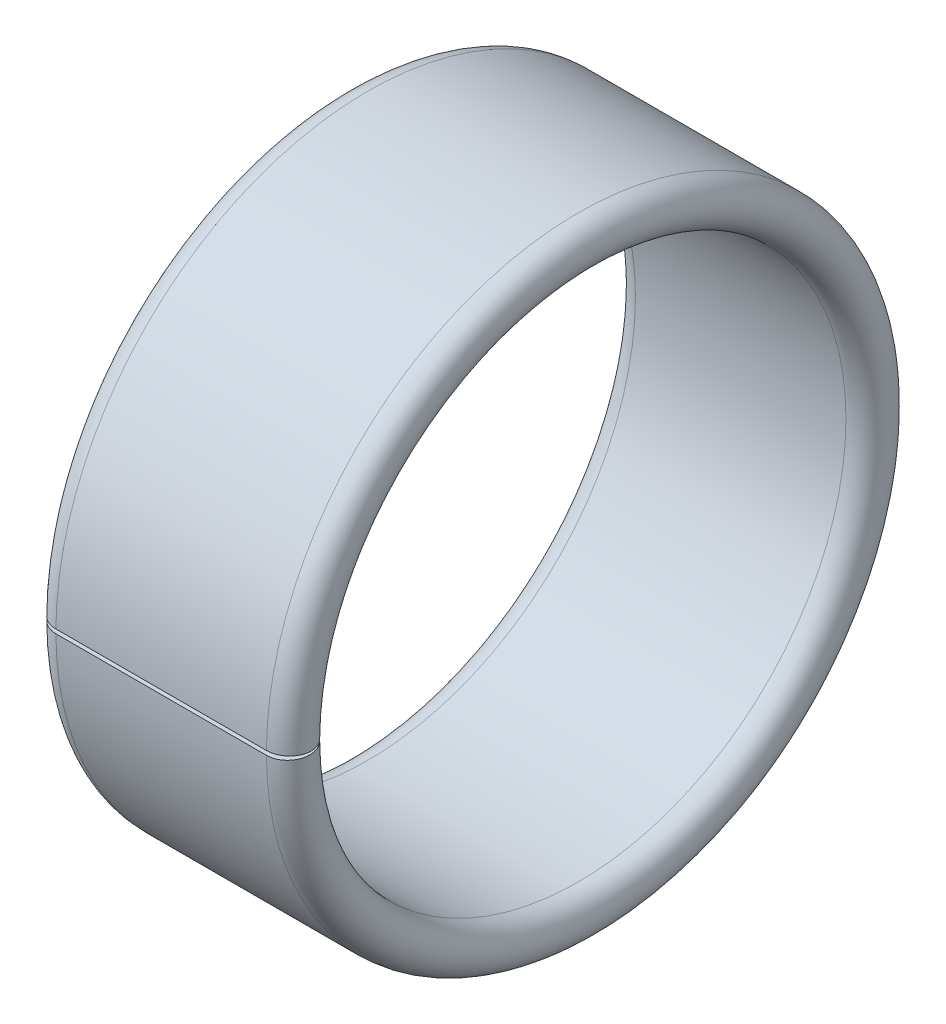
ISO-10303-21;
HEADER;
FILE_DESCRIPTION(('STEP AP214'),'2;1');
FILE_NAME('part.step','',(''),(''),'','','');
FILE_SCHEMA(('AUTOMOTIVE_DESIGN { 1 0 10303 214 1 1 1 1 }'));
ENDSEC;
DATA;
#1=APPLICATION_CONTEXT('core data for automotive mechanical design processes');
#2=APPLICATION_PROTOCOL_DEFINITION('international standard','automotive_design',2000,#1);
#3=PRODUCT_CONTEXT('',#1,'mechanical');
#4=PRODUCT('Part','Part','',(#3));
#5=PRODUCT_RELATED_PRODUCT_CATEGORY('part','',(#4));
#6=PRODUCT_DEFINITION_FORMATION('','',#4);
#7=PRODUCT_DEFINITION_CONTEXT('part definition',#1,'design');
#8=PRODUCT_DEFINITION('design','',#6,#7);
#9=PRODUCT_DEFINITION_SHAPE('','',#8);
#10=(LENGTH_UNIT() NAMED_UNIT(*) SI_UNIT(.MILLI.,.METRE.));
#11=(NAMED_UNIT(*) PLANE_ANGLE_UNIT() SI_UNIT($,.RADIAN.));
#12=(NAMED_UNIT(*) SI_UNIT($,.STERADIAN.) SOLID_ANGLE_UNIT());
#13=UNCERTAINTY_MEASURE_WITH_UNIT(LENGTH_MEASURE(1.E-05),#10,'distance_accuracy_value','');
#14=(GEOMETRIC_REPRESENTATION_CONTEXT(3) GLOBAL_UNCERTAINTY_ASSIGNED_CONTEXT((#13)) GLOBAL_UNIT_ASSIGNED_CONTEXT((#10,
#11,#12)) REPRESENTATION_CONTEXT('',''));
#15=CARTESIAN_POINT('',(0.,0.,0.));
#16=DIRECTION('',(0.,0.,1.));
#17=DIRECTION('',(1.,0.,0.));
#18=AXIS2_PLACEMENT_3D('',#15,#16,#17);
#19=CARTESIAN_POINT('',(0.425,0.,0.));
#20=DIRECTION('',(1.,0.,0.));
#21=DIRECTION('',(0.,0.,-1.));
#22=AXIS2_PLACEMENT_3D('',#19,#20,#21);
#23=TOROIDAL_SURFACE('',#22,5.575,0.425);
#24=CARTESIAN_POINT('',(0.425,0.,0.));
#25=DIRECTION('',(1.,0.,0.));
#26=DIRECTION('',(0.,0.,-1.));
#27=AXIS2_PLACEMENT_3D('',#24,#25,#26);
#28=CIRCLE('',#27,6.);
#29=CARTESIAN_POINT('',(0.425,-0.0396784115187026,5.99986880053717));
#30=VERTEX_POINT('',#29);
#31=CARTESIAN_POINT('',(0.425,0.0396784115187032,5.99986880053717));
#32=VERTEX_POINT('',#31);
#33=EDGE_CURVE('E82',#30,#32,#28,.T.);
#34=ORIENTED_EDGE('',*,*,#33,.F.);
#35=CARTESIAN_POINT('',(0.425199999999997,-0.0396784098757157,5.99986875348818));
#36=CARTESIAN_POINT('',(0.401297961018159,-0.0396795124633686,5.99990032746748));
#37=CARTESIAN_POINT('',(0.37740107020298,-0.0396088388147302,5.99787649896464));
#38=CARTESIAN_POINT('',(0.33029874051948,-0.0393291612201546,5.98986758052882));
#39=CARTESIAN_POINT('',(0.307092801505564,-0.0391202600059158,5.98388543244677));
#40=CARTESIAN_POINT('',(0.262005692115016,-0.0385692089481122,5.96810539478368));
#41=CARTESIAN_POINT('',(0.240125136849378,-0.0382269977746104,5.95830574894304));
#42=CARTESIAN_POINT('',(0.198324334070969,-0.03741936618874,5.93517820629077));
#43=CARTESIAN_POINT('',(0.178403708037,-0.0369539696314934,5.92185099260046));
#44=CARTESIAN_POINT('',(0.14107929282965,-0.0359130004402113,5.89204153517919));
#45=CARTESIAN_POINT('',(0.123675985506353,-0.0353374067617664,5.8755586888152));
#46=CARTESIAN_POINT('',(0.0918813210510851,-0.0340923703244203,5.8399055100489));
#47=CARTESIAN_POINT('',(0.0774904273012889,-0.0334229131534484,5.82073476493888));
#48=CARTESIAN_POINT('',(0.0521271438008031,-0.0320089771363153,5.78024493502642));
#49=CARTESIAN_POINT('',(0.0411559145084189,-0.0312644729362279,5.75892512418252));
#50=CARTESIAN_POINT('',(0.0229497118107499,-0.0297218165812698,5.71474922607344));
#51=CARTESIAN_POINT('',(0.0157145080871575,-0.0289236677369103,5.69189323360889));
#52=CARTESIAN_POINT('',(0.00518167017992458,-0.0272959754061034,5.64528222375724));
#53=CARTESIAN_POINT('',(0.00188569418208471,-0.0264664188503125,5.62152683211311));
#54=CARTESIAN_POINT('',(-0.000670035927541663,-0.0247997476343115,5.57379961303236));
#55=CARTESIAN_POINT('',(7.03102109674031E-05,-0.0239626327868913,5.54982778023475));
#56=CARTESIAN_POINT('',(0.00556703019496042,-0.0223044131675807,5.50234258321747));
#57=CARTESIAN_POINT('',(0.0103243748448127,-0.0214833123149389,5.4788293312304));
#58=CARTESIAN_POINT('',(0.0237215548211492,-0.0198806417794876,5.43293485184814));
#59=CARTESIAN_POINT('',(0.0323613786467166,-0.0190990719795843,5.41055362109983));
#60=CARTESIAN_POINT('',(0.0532787180155254,-0.0175976584487659,5.36755876294892));
#61=CARTESIAN_POINT('',(0.065556228572111,-0.0168778146332367,5.34694513312328));
#62=CARTESIAN_POINT('',(0.0934003339614719,-0.0155203459203222,5.30807231523663));
#63=CARTESIAN_POINT('',(0.108966764356867,-0.0148827169149774,5.28981300953904));
#64=CARTESIAN_POINT('',(0.142939524663492,-0.0137080446713584,5.25617479764636));
#65=CARTESIAN_POINT('',(0.161344540086454,-0.0131709551289628,5.24079456547471));
#66=CARTESIAN_POINT('',(0.200484474351785,-0.0122121384750847,5.21333764892238));
#67=CARTESIAN_POINT('',(0.221220119988428,-0.0117904474916054,5.20126199911234));
#68=CARTESIAN_POINT('',(0.264427480123911,-0.0110745975918477,5.18076274007033));
#69=CARTESIAN_POINT('',(0.286899374758853,-0.0107804519294058,5.17233951037857));
#70=CARTESIAN_POINT('',(0.332911748592944,-0.0103286338091498,5.15940113224911));
#71=CARTESIAN_POINT('',(0.356450543801536,-0.0101707536588862,5.15488003627782));
#72=CARTESIAN_POINT('',(0.395142694798071,-0.0100272666463959,5.15077110584534));
#73=CARTESIAN_POINT('',(0.410175457686809,-0.0099995278933128,5.1499767718863));
#74=CARTESIAN_POINT('',(0.4252,-0.0100000016432227,5.14999033830871));
#75=B_SPLINE_CURVE_WITH_KNOTS('',3,(#35,#36,#37,#38,#39,#40,#41,#42,#43,#44,#45,#46,#47,#48,#49,
#50,#51,#52,#53,#54,#55,#56,#57,#58,#59,#60,#61,#62,#63,#64,#65,#66,#67,#68,#69,#70,#71,#72,#73,
#74),.UNSPECIFIED.,.F.,.F.,(4,2,2,2,2,2,2,2,2,2,2,2,2,2,2,2,2,2,2,4),(0.,0.0716107973596128,
0.143168432759965,0.214759027573409,0.286335768839988,0.357926192818741,0.429527621059498,
0.501153320756555,0.572774604348921,0.644426025730323,0.716079226729074,0.787749749406292,
0.859420059778109,0.931090271902455,1.00275690155145,1.07439044300845,1.14604638529786,
1.21770977191114,1.28926373713111,1.33433683980956),.UNSPECIFIED.);
#76=CARTESIAN_POINT('',(0.425,-0.0100000000000006,5.14999029125298));
#77=VERTEX_POINT('',#76);
#78=EDGE_CURVE('E61',#30,#77,#75,.T.);
#79=ORIENTED_EDGE('',*,*,#78,.T.);
#80=CARTESIAN_POINT('',(0.425,0.,0.));
#81=DIRECTION('',(1.,0.,0.));
#82=DIRECTION('',(0.,0.,-1.));
#83=AXIS2_PLACEMENT_3D('',#80,#81,#82);
#84=CIRCLE('',#83,5.15);
#85=CARTESIAN_POINT('',(0.425,0.0100000000000007,5.14999029125298));
#86=VERTEX_POINT('',#85);
#87=EDGE_CURVE('E84',#77,#86,#84,.T.);
#88=ORIENTED_EDGE('',*,*,#87,.T.);
#89=CARTESIAN_POINT('',(0.4252,0.0100000016432228,5.14999033830871));
#90=CARTESIAN_POINT('',(0.401300061510052,0.00999889829661909,5.14995874259591));
#91=CARTESIAN_POINT('',(0.377405301024684,0.0100695703046586,5.15198252411814));
#92=CARTESIAN_POINT('',(0.330307348995726,0.01034923608597,5.15999110426633));
#93=CARTESIAN_POINT('',(0.30710365368102,0.0105581263873647,5.16597293984542));
#94=CARTESIAN_POINT('',(0.262020984166488,0.0111091398654659,5.18175190136663));
#95=CARTESIAN_POINT('',(0.24014262231371,0.0114513240938828,5.19155077560099));
#96=CARTESIAN_POINT('',(0.198345822686927,0.0122588791649534,5.21467612715607));
#97=CARTESIAN_POINT('',(0.178427009856835,0.0127242263711442,5.22800192761705));
#98=CARTESIAN_POINT('',(0.141103984405552,0.0137651134606776,5.25780903395185));
#99=CARTESIAN_POINT('',(0.123700461264472,0.0143406834576597,5.27429120216747));
#100=CARTESIAN_POINT('',(0.091904829281524,0.0155856628730052,5.30994274803732));
#101=CARTESIAN_POINT('',(0.077513185233488,0.0162550867483405,5.32911253968506));
#102=CARTESIAN_POINT('',(0.0521461380057571,0.0176690375651257,5.3696027934041));
#103=CARTESIAN_POINT('',(0.0411723128683477,0.0184135989889231,5.39092424292065));
#104=CARTESIAN_POINT('',(0.0229611391467007,0.0199563835120357,5.43510381128547));
#105=CARTESIAN_POINT('',(0.0157235612215139,0.0207546033142546,5.45796183571725));
#106=CARTESIAN_POINT('',(0.0051863357599662,0.0223824662686903,5.50457773159035));
#107=CARTESIAN_POINT('',(0.00188841852102415,0.0232121230631014,5.528335993693));
#108=CARTESIAN_POINT('',(-0.000670252535627302,0.0248790044326834,5.57606923078492));
#109=CARTESIAN_POINT('',(6.90917045371695E-05,0.0257162291911736,5.60004421102378));
#110=CARTESIAN_POINT('',(0.00556477624607619,0.0273745840035008,5.64753327946252));
#111=CARTESIAN_POINT('',(0.0103216797886868,0.0281957117841072,5.67104730256561));
#112=CARTESIAN_POINT('',(0.0237186286467228,0.029798431336211,5.71694318560113));
#113=CARTESIAN_POINT('',(0.0323586592759047,0.0305800232572231,5.73932504981511));
#114=CARTESIAN_POINT('',(0.0532757734050016,0.0320813721810442,5.78231805786369));
#115=CARTESIAN_POINT('',(0.0655523920533815,0.032801137071813,5.8029294275799));
#116=CARTESIAN_POINT('',(0.093394461879696,0.0341584504951348,5.84179779855444));
#117=CARTESIAN_POINT('',(0.108959747643668,0.0347960031602167,5.86005491815293));
#118=CARTESIAN_POINT('',(0.142929295267512,0.0359705105119655,5.89368840816025));
#119=CARTESIAN_POINT('',(0.161332148161209,0.0365075148334816,5.90906619992521));
#120=CARTESIAN_POINT('',(0.200467172331264,0.0374661864315201,5.93651896262178));
#121=CARTESIAN_POINT('',(0.221200070945568,0.0378878175517337,5.94859289817217));
#122=CARTESIAN_POINT('',(0.264403420111526,0.0386036195184057,5.9690907845902));
#123=CARTESIAN_POINT('',(0.286874209272734,0.0388977654516245,5.97751402203599));
#124=CARTESIAN_POINT('',(0.332884295408352,0.0393496106584256,5.99045317582262));
#125=CARTESIAN_POINT('',(0.356421910498427,0.0395075173471265,5.99497503175533));
#126=CARTESIAN_POINT('',(0.39512278058569,0.0396511121676225,5.99908704940517));
#127=CARTESIAN_POINT('',(0.410165501873883,0.0396788837872204,5.99988232453805));
#128=CARTESIAN_POINT('',(0.425199999999997,0.0396784098757162,5.99986875348818));
#129=B_SPLINE_CURVE_WITH_KNOTS('',3,(#89,#90,#91,#92,#93,#94,#95,#96,#97,#98,#99,#100,#101,#102,
#103,#104,#105,#106,#107,#108,#109,#110,#111,#112,#113,#114,#115,#116,#117,#118,#119,#120,#121,
#122,#123,#124,#125,#126,#127,#128),.UNSPECIFIED.,.F.,.F.,(4,2,2,2,2,2,2,2,2,2,2,2,2,2,2,2,2,2,
2,4),(0.,0.0716044437633951,0.143155344133726,0.214739055082886,0.286309038202233,
0.357898602711167,0.42949920680395,0.50113282079449,0.572762037197255,0.644422701570849,
0.716085106461791,0.787757559722859,0.859429741916249,0.931092766471421,1.0027521873648,
1.07437614038153,1.14602251367947,1.2176828818529,1.28923395843,1.33433689475925),.UNSPECIFIED.);
#130=EDGE_CURVE('E80',#86,#32,#129,.T.);
#131=ORIENTED_EDGE('',*,*,#130,.T.);
#132=EDGE_LOOP('',(#34,#79,#88,#131));
#133=FACE_BOUND('',#132,.T.);
#134=ADVANCED_FACE('F38',(#133),#23,.T.);
#135=CARTESIAN_POINT('',(4.9,0.,0.));
#136=DIRECTION('',(1.,0.,0.));
#137=DIRECTION('',(0.,0.,-1.));
#138=AXIS2_PLACEMENT_3D('',#135,#136,#137);
#139=CYLINDRICAL_SURFACE('',#138,5.15);
#140=ORIENTED_EDGE('',*,*,#87,.F.);
#141=DIRECTION('',(1.,0.,0.));
#142=VECTOR('',#141,1.);
#143=CARTESIAN_POINT('',(4.9,-0.0100000000000006,5.14999029125298));
#144=LINE('',#143,#142);
#145=CARTESIAN_POINT('',(4.475,-0.0100000000000006,5.14999029125298));
#146=VERTEX_POINT('',#145);
#147=EDGE_CURVE('E96',#77,#146,#144,.T.);
#148=ORIENTED_EDGE('',*,*,#147,.T.);
#149=CARTESIAN_POINT('',(4.475,0.,0.));
#150=DIRECTION('',(1.,0.,0.));
#151=DIRECTION('',(0.,0.,-1.));
#152=AXIS2_PLACEMENT_3D('',#149,#150,#151);
#153=CIRCLE('',#152,5.15);
#154=CARTESIAN_POINT('',(4.475,0.0100000000000007,5.14999029125299));
#155=VERTEX_POINT('',#154);
#156=EDGE_CURVE('E94',#146,#155,#153,.T.);
#157=ORIENTED_EDGE('',*,*,#156,.T.);
#158=DIRECTION('',(1.,0.,0.));
#159=VECTOR('',#158,1.);
#160=CARTESIAN_POINT('',(4.9,0.0100000000000007,5.14999029125298));
#161=LINE('',#160,#159);
#162=EDGE_CURVE('E111',#155,#86,#161,.F.);
#163=ORIENTED_EDGE('',*,*,#162,.T.);
#164=EDGE_LOOP('',(#140,#148,#157,#163));
#165=FACE_BOUND('',#164,.T.);
#166=ADVANCED_FACE('F110',(#165),#139,.F.);
#167=CARTESIAN_POINT('',(4.9,0.,0.));
#168=DIRECTION('',(1.,0.,0.));
#169=DIRECTION('',(0.,0.,-1.));
#170=AXIS2_PLACEMENT_3D('',#167,#168,#169);
#171=CYLINDRICAL_SURFACE('',#170,6.);
#172=CARTESIAN_POINT('',(4.475,0.,0.));
#173=DIRECTION('',(1.,0.,0.));
#174=DIRECTION('',(0.,0.,-1.));
#175=AXIS2_PLACEMENT_3D('',#172,#173,#174);
#176=CIRCLE('',#175,6.);
#177=CARTESIAN_POINT('',(4.475,-0.0396784115187026,5.99986880053717));
#178=VERTEX_POINT('',#177);
#179=CARTESIAN_POINT('',(4.475,0.0396784115187032,5.99986880053717));
#180=VERTEX_POINT('',#179);
#181=EDGE_CURVE('E92',#178,#180,#176,.T.);
#182=ORIENTED_EDGE('',*,*,#181,.F.);
#183=DIRECTION('',(1.,0.,0.));
#184=VECTOR('',#183,1.);
#185=CARTESIAN_POINT('',(4.9,-0.0396784115187026,5.99986880053717));
#186=LINE('',#185,#184);
#187=EDGE_CURVE('E11',#178,#30,#186,.F.);
#188=ORIENTED_EDGE('',*,*,#187,.T.);
#189=ORIENTED_EDGE('',*,*,#33,.T.);
#190=DIRECTION('',(1.,0.,0.));
#191=VECTOR('',#190,1.);
#192=CARTESIAN_POINT('',(4.9,0.0396784115187032,5.99986880053717));
#193=LINE('',#192,#191);
#194=EDGE_CURVE('E46',#32,#180,#193,.T.);
#195=ORIENTED_EDGE('',*,*,#194,.T.);
#196=EDGE_LOOP('',(#182,#188,#189,#195));
#197=FACE_BOUND('',#196,.T.);
#198=ADVANCED_FACE('F91',(#197),#171,.T.);
#199=CARTESIAN_POINT('',(4.475,0.,0.));
#200=DIRECTION('',(1.,0.,0.));
#201=DIRECTION('',(0.,0.,-1.));
#202=AXIS2_PLACEMENT_3D('',#199,#200,#201);
#203=TOROIDAL_SURFACE('',#202,5.575,0.425);
#204=ORIENTED_EDGE('',*,*,#156,.F.);
#205=CARTESIAN_POINT('',(4.4748,-0.0100000016432227,5.14999033830871));
#206=CARTESIAN_POINT('',(4.49869993848995,-0.00999889829661895,5.14995874259591));
#207=CARTESIAN_POINT('',(4.52259469897532,-0.0100695703046584,5.15198252411814));
#208=CARTESIAN_POINT('',(4.56969265100427,-0.0103492360859698,5.15999110426633));
#209=CARTESIAN_POINT('',(4.59289634631898,-0.0105581263873646,5.16597293984542));
#210=CARTESIAN_POINT('',(4.63797901583351,-0.0111091398654657,5.18175190136662));
#211=CARTESIAN_POINT('',(4.65985737768629,-0.0114513240938826,5.19155077560099));
#212=CARTESIAN_POINT('',(4.70165417731307,-0.0122588791649532,5.21467612715607));
#213=CARTESIAN_POINT('',(4.72157299014316,-0.0127242263711441,5.22800192761705));
#214=CARTESIAN_POINT('',(4.75889601559445,-0.0137651134606774,5.25780903395184));
#215=CARTESIAN_POINT('',(4.77629953873553,-0.0143406834576594,5.27429120216747));
#216=CARTESIAN_POINT('',(4.80809517071848,-0.0155856628730049,5.30994274803732));
#217=CARTESIAN_POINT('',(4.82248681476651,-0.0162550867483402,5.32911253968506));
#218=CARTESIAN_POINT('',(4.84785386199424,-0.0176690375651254,5.3696027934041));
#219=CARTESIAN_POINT('',(4.85882768713165,-0.0184135989889228,5.39092424292065));
#220=CARTESIAN_POINT('',(4.8770388608533,-0.0199563835120354,5.43510381128547));
#221=CARTESIAN_POINT('',(4.88427643877849,-0.0207546033142542,5.45796183571725));
#222=CARTESIAN_POINT('',(4.89481366424003,-0.0223824662686899,5.50457773159035));
#223=CARTESIAN_POINT('',(4.89811158147898,-0.023212123063101,5.52833599369299));
#224=CARTESIAN_POINT('',(4.90067025253563,-0.024879004432683,5.57606923078492));
#225=CARTESIAN_POINT('',(4.89993090829546,-0.0257162291911732,5.60004421102377));
#226=CARTESIAN_POINT('',(4.89443522375393,-0.0273745840035003,5.64753327946252));
#227=CARTESIAN_POINT('',(4.88967832021132,-0.0281957117841068,5.6710473025656));
#228=CARTESIAN_POINT('',(4.87628137135328,-0.0297984313362105,5.71694318560113));
#229=CARTESIAN_POINT('',(4.8676413407241,-0.0305800232572226,5.73932504981511));
#230=CARTESIAN_POINT('',(4.846724226595,-0.0320813721810438,5.78231805786369));
#231=CARTESIAN_POINT('',(4.83444760794662,-0.0328011370718125,5.80292942757989));
#232=CARTESIAN_POINT('',(4.80660553812031,-0.0341584504951343,5.84179779855444));
#233=CARTESIAN_POINT('',(4.79104025235634,-0.0347960031602162,5.86005491815292));
#234=CARTESIAN_POINT('',(4.75707070473249,-0.035970510511965,5.89368840816025));
#235=CARTESIAN_POINT('',(4.7386678518388,-0.0365075148334811,5.90906619992521));
#236=CARTESIAN_POINT('',(4.69953282766874,-0.0374661864315196,5.93651896262178));
#237=CARTESIAN_POINT('',(4.67879992905443,-0.0378878175517332,5.94859289817217));
#238=CARTESIAN_POINT('',(4.63559657988848,-0.0386036195184051,5.9690907845902));
#239=CARTESIAN_POINT('',(4.61312579072727,-0.038897765451624,5.977514022036));
#240=CARTESIAN_POINT('',(4.56711570459165,-0.0393496106584251,5.99045317582263));
#241=CARTESIAN_POINT('',(4.54357808950158,-0.039507517347126,5.99497503175533));
#242=CARTESIAN_POINT('',(4.50487721941431,-0.039651112167622,5.99908704940517));
#243=CARTESIAN_POINT('',(4.48983449812612,-0.0396788837872199,5.99988232453805));
#244=CARTESIAN_POINT('',(4.4748,-0.0396784098757157,5.99986875348818));
#245=B_SPLINE_CURVE_WITH_KNOTS('',3,(#205,#206,#207,#208,#209,#210,#211,#212,#213,#214,#215,
#216,#217,#218,#219,#220,#221,#222,#223,#224,#225,#226,#227,#228,#229,#230,#231,#232,#233,#234,
#235,#236,#237,#238,#239,#240,#241,#242,#243,#244),.UNSPECIFIED.,.F.,.F.,(4,2,2,2,2,2,2,2,2,2,2,
2,2,2,2,2,2,2,2,4),(0.,0.071604443763395,0.143155344133725,0.214739055082886,0.286309038202233,
0.357898602711168,0.429499206803949,0.501132820794489,0.572762037197254,0.644422701570847,
0.71608510646179,0.787757559722857,0.85942974191625,0.931092766471421,1.00275218736479,
1.07437614038153,1.14602251367947,1.2176828818529,1.28923395843,1.33433689475926),.UNSPECIFIED.);
#246=EDGE_CURVE('E114',#146,#178,#245,.T.);
#247=ORIENTED_EDGE('',*,*,#246,.T.);
#248=ORIENTED_EDGE('',*,*,#181,.T.);
#249=CARTESIAN_POINT('',(4.4748,0.0396784098757162,5.99986875348818));
#250=CARTESIAN_POINT('',(4.49870203898184,0.0396795124633691,5.99990032746748));
#251=CARTESIAN_POINT('',(4.52259892979702,0.0396088388147307,5.99787649896464));
#252=CARTESIAN_POINT('',(4.56970125948052,0.0393291612201551,5.98986758052882));
#253=CARTESIAN_POINT('',(4.59290719849444,0.0391202600059163,5.98388543244677));
#254=CARTESIAN_POINT('',(4.63799430788498,0.0385692089481127,5.96810539478368));
#255=CARTESIAN_POINT('',(4.65987486315062,0.0382269977746109,5.95830574894304));
#256=CARTESIAN_POINT('',(4.70167566592903,0.0374193661887405,5.93517820629077));
#257=CARTESIAN_POINT('',(4.721596291963,0.0369539696314939,5.92185099260046));
#258=CARTESIAN_POINT('',(4.75892070717035,0.0359130004402118,5.8920415351792));
#259=CARTESIAN_POINT('',(4.77632401449365,0.0353374067617668,5.8755586888152));
#260=CARTESIAN_POINT('',(4.80811867894892,0.0340923703244208,5.8399055100489));
#261=CARTESIAN_POINT('',(4.82250957269871,0.0334229131534488,5.82073476493888));
#262=CARTESIAN_POINT('',(4.8478728561992,0.0320089771363157,5.78024493502642));
#263=CARTESIAN_POINT('',(4.85884408549158,0.0312644729362283,5.75892512418252));
#264=CARTESIAN_POINT('',(4.87705028818925,0.0297218165812702,5.71474922607344));
#265=CARTESIAN_POINT('',(4.88428549191284,0.0289236677369108,5.6918932336089));
#266=CARTESIAN_POINT('',(4.89481832982008,0.0272959754061038,5.64528222375725));
#267=CARTESIAN_POINT('',(4.89811430581792,0.0264664188503129,5.62152683211311));
#268=CARTESIAN_POINT('',(4.90067003592754,0.0247997476343119,5.57379961303236));
#269=CARTESIAN_POINT('',(4.89992968978903,0.0239626327868917,5.54982778023475));
#270=CARTESIAN_POINT('',(4.89443296980504,0.022304413167581,5.50234258321747));
#271=CARTESIAN_POINT('',(4.88967562515519,0.0214833123149393,5.4788293312304));
#272=CARTESIAN_POINT('',(4.87627844517885,0.0198806417794878,5.43293485184814));
#273=CARTESIAN_POINT('',(4.86763862135328,0.0190990719795845,5.41055362109983));
#274=CARTESIAN_POINT('',(4.84672128198448,0.0175976584487661,5.36755876294892));
#275=CARTESIAN_POINT('',(4.83444377142789,0.0168778146332369,5.34694513312328));
#276=CARTESIAN_POINT('',(4.80659966603853,0.0155203459203225,5.30807231523663));
#277=CARTESIAN_POINT('',(4.79103323564313,0.0148827169149776,5.28981300953904));
#278=CARTESIAN_POINT('',(4.75706047533651,0.0137080446713586,5.25617479764636));
#279=CARTESIAN_POINT('',(4.73865545991355,0.0131709551289631,5.24079456547471));
#280=CARTESIAN_POINT('',(4.69951552564822,0.0122121384750849,5.21333764892238));
#281=CARTESIAN_POINT('',(4.67877988001158,0.0117904474916056,5.20126199911234));
#282=CARTESIAN_POINT('',(4.63557251987609,0.0110745975918479,5.18076274007033));
#283=CARTESIAN_POINT('',(4.61310062524115,0.010780451929406,5.17233951037857));
#284=CARTESIAN_POINT('',(4.56708825140706,0.0103286338091499,5.15940113224911));
#285=CARTESIAN_POINT('',(4.54354945619847,0.0101707536588863,5.15488003627782));
#286=CARTESIAN_POINT('',(4.50485730520193,0.0100272666463961,5.15077110584534));
#287=CARTESIAN_POINT('',(4.48982454231319,0.00999952789331292,5.1499767718863));
#288=CARTESIAN_POINT('',(4.4748,0.0100000016432228,5.14999033830871));
#289=B_SPLINE_CURVE_WITH_KNOTS('',3,(#249,#250,#251,#252,#253,#254,#255,#256,#257,#258,#259,
#260,#261,#262,#263,#264,#265,#266,#267,#268,#269,#270,#271,#272,#273,#274,#275,#276,#277,#278,
#279,#280,#281,#282,#283,#284,#285,#286,#287,#288),.UNSPECIFIED.,.F.,.F.,(4,2,2,2,2,2,2,2,2,2,2,
2,2,2,2,2,2,2,2,4),(0.,0.0716107973596126,0.143168432759965,0.214759027573409,0.286335768839989,
0.357926192818741,0.429527621059498,0.501153320756556,0.572774604348921,0.644426025730323,
0.716079226729073,0.787749749406292,0.859420059778111,0.931090271902456,1.00275690155145,
1.07439044300844,1.14604638529786,1.21770977191114,1.28926373713111,1.33433683980956),.UNSPECIFIED.);
#290=EDGE_CURVE('E53',#180,#155,#289,.T.);
#291=ORIENTED_EDGE('',*,*,#290,.T.);
#292=EDGE_LOOP('',(#204,#247,#248,#291));
#293=FACE_BOUND('',#292,.T.);
#294=ADVANCED_FACE('F113',(#293),#203,.T.);
#295=CARTESIAN_POINT('',(4.9,0.,4.8636277584238));
#296=DIRECTION('',(0.,-0.999390827019096,0.0348994967025));
#297=DIRECTION('',(0.,-0.0348994967025,-0.999390827019096));
#298=AXIS2_PLACEMENT_3D('',#295,#296,#297);
#299=PLANE('',#298);
#300=ORIENTED_EDGE('',*,*,#290,.F.);
#301=ORIENTED_EDGE('',*,*,#194,.F.);
#302=ORIENTED_EDGE('',*,*,#130,.F.);
#303=ORIENTED_EDGE('',*,*,#162,.F.);
#304=EDGE_LOOP('',(#300,#301,#302,#303));
#305=FACE_BOUND('',#304,.T.);
#306=ADVANCED_FACE('F87',(#305),#299,.T.);
#307=CARTESIAN_POINT('',(4.9,-0.074589884561991,6.9996025850845));
#308=DIRECTION('',(0.,0.999390827019096,0.0348994967024995));
#309=DIRECTION('',(0.,-0.0348994967024995,0.999390827019096));
#310=AXIS2_PLACEMENT_3D('',#307,#308,#309);
#311=PLANE('',#310);
#312=ORIENTED_EDGE('',*,*,#187,.F.);
#313=ORIENTED_EDGE('',*,*,#246,.F.);
#314=ORIENTED_EDGE('',*,*,#147,.F.);
#315=ORIENTED_EDGE('',*,*,#78,.F.);
#316=EDGE_LOOP('',(#312,#313,#314,#315));
#317=FACE_BOUND('',#316,.T.);
#318=ADVANCED_FACE('F131',(#317),#311,.T.);
#319=CLOSED_SHELL('',(#134,#166,#198,#294,#306,#318));
#320=MANIFOLD_SOLID_BREP('B2',#319);
#321=ADVANCED_BREP_SHAPE_REPRESENTATION('',(#18,#320),#14);
#322=SHAPE_DEFINITION_REPRESENTATION(#9,#321);
ENDSEC;
END-ISO-10303-21;
